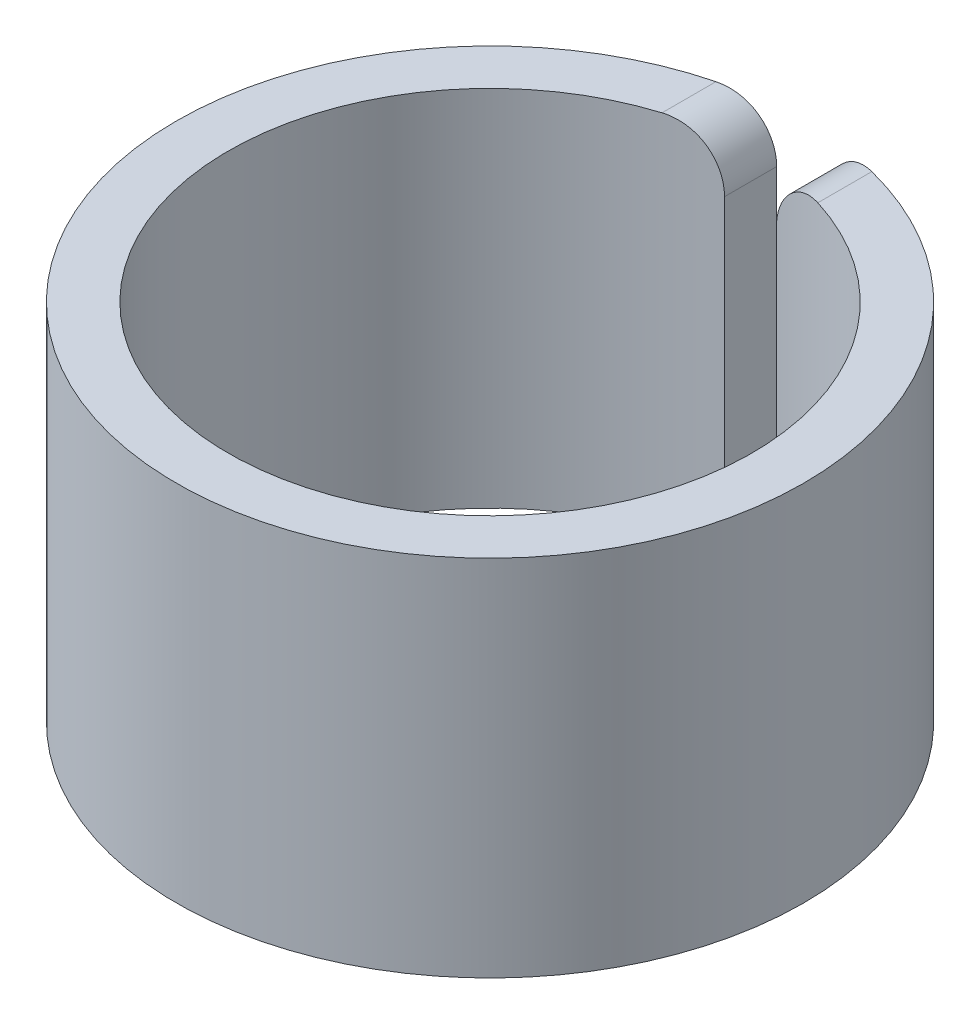
ISO-10303-21;
HEADER;
FILE_DESCRIPTION(('STEP AP214'),'2;1');
FILE_NAME('part.step','',(''),(''),'','','');
FILE_SCHEMA(('AUTOMOTIVE_DESIGN { 1 0 10303 214 1 1 1 1 }'));
ENDSEC;
DATA;
#1=APPLICATION_CONTEXT('core data for automotive mechanical design processes');
#2=APPLICATION_PROTOCOL_DEFINITION('international standard','automotive_design',2000,#1);
#3=PRODUCT_CONTEXT('',#1,'mechanical');
#4=PRODUCT('Part','Part','',(#3));
#5=PRODUCT_RELATED_PRODUCT_CATEGORY('part','',(#4));
#6=PRODUCT_DEFINITION_FORMATION('','',#4);
#7=PRODUCT_DEFINITION_CONTEXT('part definition',#1,'design');
#8=PRODUCT_DEFINITION('design','',#6,#7);
#9=PRODUCT_DEFINITION_SHAPE('','',#8);
#10=(LENGTH_UNIT() NAMED_UNIT(*) SI_UNIT(.MILLI.,.METRE.));
#11=(NAMED_UNIT(*) PLANE_ANGLE_UNIT() SI_UNIT($,.RADIAN.));
#12=(NAMED_UNIT(*) SI_UNIT($,.STERADIAN.) SOLID_ANGLE_UNIT());
#13=UNCERTAINTY_MEASURE_WITH_UNIT(LENGTH_MEASURE(1.E-05),#10,'distance_accuracy_value','');
#14=(GEOMETRIC_REPRESENTATION_CONTEXT(3) GLOBAL_UNCERTAINTY_ASSIGNED_CONTEXT((#13)) GLOBAL_UNIT_ASSIGNED_CONTEXT((#10,
#11,#12)) REPRESENTATION_CONTEXT('',''));
#15=CARTESIAN_POINT('',(0.,0.,0.));
#16=DIRECTION('',(0.,0.,1.));
#17=DIRECTION('',(1.,0.,0.));
#18=AXIS2_PLACEMENT_3D('',#15,#16,#17);
#19=CARTESIAN_POINT('',(0.,3.5,0.));
#20=DIRECTION('',(0.,1.,0.));
#21=DIRECTION('',(0.,0.,1.));
#22=AXIS2_PLACEMENT_3D('',#19,#20,#21);
#23=PLANE('',#22);
#24=CARTESIAN_POINT('',(0.,3.5,0.));
#25=DIRECTION('',(0.,1.,0.));
#26=DIRECTION('',(1.,0.,0.));
#27=AXIS2_PLACEMENT_3D('',#24,#25,#26);
#28=CIRCLE('',#27,6.04);
#29=CARTESIAN_POINT('',(-1.50000000000031,3.5,-5.85077772608045));
#30=VERTEX_POINT('',#29);
#31=CARTESIAN_POINT('',(1.5000000000003,3.5,-5.85077772608045));
#32=VERTEX_POINT('',#31);
#33=EDGE_CURVE('E212',#30,#32,#28,.T.);
#34=ORIENTED_EDGE('',*,*,#33,.T.);
#35=DIRECTION('',(0.,0.,-1.));
#36=VECTOR('',#35,1.);
#37=CARTESIAN_POINT('',(1.5000000000003,3.5,-5.01513708686011));
#38=LINE('',#37,#36);
#39=CARTESIAN_POINT('',(1.5000000000003,3.5,-4.8116109568417));
#40=VERTEX_POINT('',#39);
#41=EDGE_CURVE('E130',#32,#40,#38,.F.);
#42=ORIENTED_EDGE('',*,*,#41,.T.);
#43=CARTESIAN_POINT('',(0.,3.5,0.));
#44=DIRECTION('',(0.,1.,0.));
#45=DIRECTION('',(0.,0.,1.));
#46=AXIS2_PLACEMENT_3D('',#43,#44,#45);
#47=CIRCLE('',#46,5.04);
#48=CARTESIAN_POINT('',(-1.50000000000031,3.5,-4.8116109568417));
#49=VERTEX_POINT('',#48);
#50=EDGE_CURVE('E216',#49,#40,#47,.T.);
#51=ORIENTED_EDGE('',*,*,#50,.F.);
#52=DIRECTION('',(0.,0.,1.));
#53=VECTOR('',#52,1.);
#54=CARTESIAN_POINT('',(-1.50000000000031,3.5,-6.01926905861498));
#55=LINE('',#54,#53);
#56=EDGE_CURVE('E133',#49,#30,#55,.F.);
#57=ORIENTED_EDGE('',*,*,#56,.T.);
#58=EDGE_LOOP('',(#34,#42,#51,#57));
#59=FACE_BOUND('',#58,.T.);
#60=ADVANCED_FACE('F39',(#59),#23,.T.);
#61=CARTESIAN_POINT('',(0.,-3.5,0.));
#62=DIRECTION('',(0.,1.,0.));
#63=DIRECTION('',(0.,0.,1.));
#64=AXIS2_PLACEMENT_3D('',#61,#62,#63);
#65=PLANE('',#64);
#66=CARTESIAN_POINT('',(0.,-3.5,0.));
#67=DIRECTION('',(0.,1.,0.));
#68=DIRECTION('',(1.,0.,0.));
#69=AXIS2_PLACEMENT_3D('',#66,#67,#68);
#70=CIRCLE('',#69,6.04);
#71=CARTESIAN_POINT('',(-1.50000000000031,-3.5,-5.85077772608045));
#72=VERTEX_POINT('',#71);
#73=CARTESIAN_POINT('',(1.5000000000003,-3.5,-5.85077772608045));
#74=VERTEX_POINT('',#73);
#75=EDGE_CURVE('E213',#72,#74,#70,.T.);
#76=ORIENTED_EDGE('',*,*,#75,.F.);
#77=DIRECTION('',(0.,0.,1.));
#78=VECTOR('',#77,1.);
#79=CARTESIAN_POINT('',(-1.50000000000031,-3.5,0.));
#80=LINE('',#79,#78);
#81=CARTESIAN_POINT('',(-1.50000000000031,-3.5,-4.8116109568417));
#82=VERTEX_POINT('',#81);
#83=EDGE_CURVE('E12',#72,#82,#80,.T.);
#84=ORIENTED_EDGE('',*,*,#83,.T.);
#85=CARTESIAN_POINT('',(0.,-3.5,0.));
#86=DIRECTION('',(0.,1.,0.));
#87=DIRECTION('',(0.,0.,1.));
#88=AXIS2_PLACEMENT_3D('',#85,#86,#87);
#89=CIRCLE('',#88,5.04);
#90=CARTESIAN_POINT('',(1.5000000000003,-3.5,-4.8116109568417));
#91=VERTEX_POINT('',#90);
#92=EDGE_CURVE('E219',#82,#91,#89,.T.);
#93=ORIENTED_EDGE('',*,*,#92,.T.);
#94=DIRECTION('',(0.,0.,-1.));
#95=VECTOR('',#94,1.);
#96=CARTESIAN_POINT('',(1.50000000000031,-3.5,0.));
#97=LINE('',#96,#95);
#98=EDGE_CURVE('E48',#91,#74,#97,.T.);
#99=ORIENTED_EDGE('',*,*,#98,.T.);
#100=EDGE_LOOP('',(#76,#84,#93,#99));
#101=FACE_BOUND('',#100,.T.);
#102=ADVANCED_FACE('F199',(#101),#65,.F.);
#103=CARTESIAN_POINT('',(0.,3.5,0.));
#104=DIRECTION('',(0.,-1.,0.));
#105=DIRECTION('',(0.,0.,-1.));
#106=AXIS2_PLACEMENT_3D('',#103,#104,#105);
#107=CYLINDRICAL_SURFACE('',#106,6.04);
#108=DIRECTION('',(0.,-1.,0.));
#109=VECTOR('',#108,1.);
#110=CARTESIAN_POINT('',(0.500000000000303,3.5,-6.01926905861498));
#111=LINE('',#110,#109);
#112=CARTESIAN_POINT('',(0.500000000000303,-2.5,-6.01926905861498));
#113=VERTEX_POINT('',#112);
#114=CARTESIAN_POINT('',(0.500000000000303,2.5,-6.01926905861498));
#115=VERTEX_POINT('',#114);
#116=EDGE_CURVE('E115',#113,#115,#111,.F.);
#117=ORIENTED_EDGE('',*,*,#116,.T.);
#118=CARTESIAN_POINT('',(0.500000000000303,2.5,-6.01926905861498));
#119=CARTESIAN_POINT('',(0.500000147538638,2.52801511580829,-6.01926792187514));
#120=CARTESIAN_POINT('',(0.501178018526926,2.55601683338028,-6.0191713314579));
#121=CARTESIAN_POINT('',(0.505876756069402,2.61182037486417,-6.0187786884757));
#122=CARTESIAN_POINT('',(0.509397525494623,2.63962220701439,-6.01848264417946));
#123=CARTESIAN_POINT('',(0.523440795911717,2.72238418462499,-6.01728375625036));
#124=CARTESIAN_POINT('',(0.537444349863762,2.77679071900414,-6.01607020719416));
#125=CARTESIAN_POINT('',(0.574336183166915,2.88247193719496,-6.0126597358256));
#126=CARTESIAN_POINT('',(0.597229092910345,2.93374497265652,-6.01046230092373));
#127=CARTESIAN_POINT('',(0.651221256614512,3.03169473174886,-6.00485174931685));
#128=CARTESIAN_POINT('',(0.682318917485741,3.07837234524423,-6.00143886856601));
#129=CARTESIAN_POINT('',(0.751737827040241,3.16574249073153,-5.99313829226483));
#130=CARTESIAN_POINT('',(0.79004863317618,3.20644352532634,-5.98825272267212));
#131=CARTESIAN_POINT('',(0.872761097291666,3.28080970899916,-5.9767572564229));
#132=CARTESIAN_POINT('',(0.917163062779286,3.31447450264061,-5.97014727269531));
#133=CARTESIAN_POINT('',(1.0106746306673,3.37385839935954,-5.95502953227151));
#134=CARTESIAN_POINT('',(1.05978262139599,3.39958021001693,-5.94652242396808));
#135=CARTESIAN_POINT('',(1.16124414357262,3.44248403970932,-5.92754343910031));
#136=CARTESIAN_POINT('',(1.2135972570549,3.45966715595205,-5.91707181521121));
#137=CARTESIAN_POINT('',(1.30517106124924,3.48163278777757,-5.89742920077249));
#138=CARTESIAN_POINT('',(1.34399592878338,3.48853479347084,-5.88870608691224));
#139=CARTESIAN_POINT('',(1.42191280396622,3.49771828045074,-5.87038183772152));
#140=CARTESIAN_POINT('',(1.46100423448013,3.50000772065479,-5.86078224472285));
#141=CARTESIAN_POINT('',(1.5000000000003,3.5,-5.85077772608045));
#142=B_SPLINE_CURVE_WITH_KNOTS('',3,(#118,#119,#120,#121,#122,#123,#124,#125,#126,#127,#128,
#129,#130,#131,#132,#133,#134,#135,#136,#137,#138,#139,#140,#141),.UNSPECIFIED.,.F.,.F.,(4,2,2,
2,2,2,2,2,2,2,2,4),(0.,0.0839938001038455,0.167984118314159,0.335698459748334,0.503500279649101,
0.671269541970228,0.838797764919631,1.006334448533,1.17381395954846,1.34127194416278,
1.46217054404459,1.58286035580051),.UNSPECIFIED.);
#143=EDGE_CURVE('E186',#115,#32,#142,.T.);
#144=ORIENTED_EDGE('',*,*,#143,.T.);
#145=ORIENTED_EDGE('',*,*,#33,.F.);
#146=CARTESIAN_POINT('',(-1.50000000000031,3.5,-5.85077772608045));
#147=CARTESIAN_POINT('',(-1.4721998573771,3.49999956408464,-5.85790610267146));
#148=CARTESIAN_POINT('',(-1.44435978180637,3.49883987592234,-5.86483110534403));
#149=CARTESIAN_POINT('',(-1.38876592900515,3.49418620818695,-5.87824339439247));
#150=CARTESIAN_POINT('',(-1.36101216359701,3.49069192185657,-5.88473062312316));
#151=CARTESIAN_POINT('',(-1.27818425629119,3.47669130318036,-5.90347657873336));
#152=CARTESIAN_POINT('',(-1.22349908285171,3.46266725690404,-5.91503092776452));
#153=CARTESIAN_POINT('',(-1.11687283618476,3.42542458694574,-5.93608966518361));
#154=CARTESIAN_POINT('',(-1.06493561100482,3.40219343733993,-5.94559123351601));
#155=CARTESIAN_POINT('',(-0.965524964342736,3.34709021852483,-5.96254169654858));
#156=CARTESIAN_POINT('',(-0.918048925009836,3.31522326004576,-5.96999180007869));
#157=CARTESIAN_POINT('',(-0.829959143016247,3.24442972629992,-5.98286845908603));
#158=CARTESIAN_POINT('',(-0.789227533931792,3.20565643747073,-5.9883323702646));
#159=CARTESIAN_POINT('',(-0.714747844311709,3.12171326643041,-5.99767856181006));
#160=CARTESIAN_POINT('',(-0.681001606045793,3.07654170206272,-6.00156042520029));
#161=CARTESIAN_POINT('',(-0.621768165515724,2.9814798996119,-6.00798539968069));
#162=CARTESIAN_POINT('',(-0.596219704465806,2.93162843932292,-6.01053853365416));
#163=CARTESIAN_POINT('',(-0.553793715007384,2.82833843916365,-6.01459635671826));
#164=CARTESIAN_POINT('',(-0.536911040401493,2.77490204958206,-6.01610166825027));
#165=CARTESIAN_POINT('',(-0.516428219291182,2.68429332007422,-6.01788743306866));
#166=CARTESIAN_POINT('',(-0.510271755081222,2.6476826967012,-6.01840942627051));
#167=CARTESIAN_POINT('',(-0.502057939228013,2.57405307654975,-6.01909814898589));
#168=CARTESIAN_POINT('',(-0.499994873206612,2.53703472171021,-6.01926537377826));
#169=CARTESIAN_POINT('',(-0.500000000000306,2.5,-6.01926905861498));
#170=B_SPLINE_CURVE_WITH_KNOTS('',3,(#146,#147,#148,#149,#150,#151,#152,#153,#154,#155,#156,
#157,#158,#159,#160,#161,#162,#163,#164,#165,#166,#167,#168,#169),.UNSPECIFIED.,.F.,.F.,(4,2,2,
2,2,2,2,2,2,2,2,4),(0.,0.0860496929543468,0.172110694734235,0.344096862670815,0.516317819068098,
0.688437075678145,0.857127430326559,1.02586221758934,1.19330504885029,1.36064832841956,
1.4718181265732,1.58283262234606),.UNSPECIFIED.);
#171=CARTESIAN_POINT('',(-0.500000000000306,2.5,-6.01926905861498));
#172=VERTEX_POINT('',#171);
#173=EDGE_CURVE('E179',#30,#172,#170,.T.);
#174=ORIENTED_EDGE('',*,*,#173,.T.);
#175=DIRECTION('',(0.,-1.,0.));
#176=VECTOR('',#175,1.);
#177=CARTESIAN_POINT('',(-0.500000000000306,3.5,-6.01926905861498));
#178=LINE('',#177,#176);
#179=CARTESIAN_POINT('',(-0.500000000000306,-2.5,-6.01926905861498));
#180=VERTEX_POINT('',#179);
#181=EDGE_CURVE('E223',#172,#180,#178,.T.);
#182=ORIENTED_EDGE('',*,*,#181,.T.);
#183=CARTESIAN_POINT('',(-0.500000000000306,-2.5,-6.01926905861498));
#184=CARTESIAN_POINT('',(-0.500000147538642,-2.52801511580829,-6.01926792187514));
#185=CARTESIAN_POINT('',(-0.501178018526929,-2.55601683338028,-6.0191713314579));
#186=CARTESIAN_POINT('',(-0.505876756069406,-2.61182037486417,-6.0187786884757));
#187=CARTESIAN_POINT('',(-0.509397525494626,-2.63962220701439,-6.01848264417946));
#188=CARTESIAN_POINT('',(-0.523440795911721,-2.72238418462499,-6.01728375625036));
#189=CARTESIAN_POINT('',(-0.537444349863765,-2.77679071900414,-6.01607020719416));
#190=CARTESIAN_POINT('',(-0.574336183166918,-2.88247193719496,-6.0126597358256));
#191=CARTESIAN_POINT('',(-0.597229092910349,-2.93374497265652,-6.01046230092373));
#192=CARTESIAN_POINT('',(-0.651221256614516,-3.03169473174886,-6.00485174931685));
#193=CARTESIAN_POINT('',(-0.682318917485745,-3.07837234524423,-6.00143886856601));
#194=CARTESIAN_POINT('',(-0.751737827040244,-3.16574249073153,-5.99313829226483));
#195=CARTESIAN_POINT('',(-0.790048633176183,-3.20644352532634,-5.98825272267212));
#196=CARTESIAN_POINT('',(-0.87276109729167,-3.28080970899916,-5.9767572564229));
#197=CARTESIAN_POINT('',(-0.91716306277929,-3.31447450264061,-5.97014727269531));
#198=CARTESIAN_POINT('',(-1.0106746306673,-3.37385839935954,-5.95502953227151));
#199=CARTESIAN_POINT('',(-1.05978262139599,-3.39958021001693,-5.94652242396808));
#200=CARTESIAN_POINT('',(-1.16124414357262,-3.44248403970933,-5.92754343910031));
#201=CARTESIAN_POINT('',(-1.2135972570549,-3.45966715595205,-5.91707181521121));
#202=CARTESIAN_POINT('',(-1.30517106124925,-3.48163278777757,-5.89742920077249));
#203=CARTESIAN_POINT('',(-1.34399592878338,-3.48853479347084,-5.88870608691224));
#204=CARTESIAN_POINT('',(-1.42191280396622,-3.49771828045074,-5.87038183772152));
#205=CARTESIAN_POINT('',(-1.46100423448013,-3.50000772065479,-5.86078224472285));
#206=CARTESIAN_POINT('',(-1.50000000000031,-3.5,-5.85077772608045));
#207=B_SPLINE_CURVE_WITH_KNOTS('',3,(#183,#184,#185,#186,#187,#188,#189,#190,#191,#192,#193,
#194,#195,#196,#197,#198,#199,#200,#201,#202,#203,#204,#205,#206),.UNSPECIFIED.,.F.,.F.,(4,2,2,
2,2,2,2,2,2,2,2,4),(0.,0.0839938001038459,0.16798411831416,0.335698459748334,0.503500279649101,
0.671269541970228,0.838797764919632,1.006334448533,1.17381395954846,1.34127194416278,
1.46217054404459,1.58286035580051),.UNSPECIFIED.);
#208=EDGE_CURVE('E187',#180,#72,#207,.T.);
#209=ORIENTED_EDGE('',*,*,#208,.T.);
#210=ORIENTED_EDGE('',*,*,#75,.T.);
#211=CARTESIAN_POINT('',(1.5000000000003,-3.5,-5.85077772608045));
#212=CARTESIAN_POINT('',(1.47219985737709,-3.49999956408464,-5.85790610267147));
#213=CARTESIAN_POINT('',(1.44435978180637,-3.49883987592234,-5.86483110534404));
#214=CARTESIAN_POINT('',(1.38876592900515,-3.49418620818695,-5.87824339439247));
#215=CARTESIAN_POINT('',(1.36101216359701,-3.49069192185657,-5.88473062312316));
#216=CARTESIAN_POINT('',(1.27818425629118,-3.47669130318036,-5.90347657873336));
#217=CARTESIAN_POINT('',(1.22349908285171,-3.46266725690404,-5.91503092776452));
#218=CARTESIAN_POINT('',(1.11687283618475,-3.42542458694574,-5.93608966518361));
#219=CARTESIAN_POINT('',(1.06493561100481,-3.40219343733993,-5.94559123351601));
#220=CARTESIAN_POINT('',(0.965524964342732,-3.34709021852483,-5.96254169654858));
#221=CARTESIAN_POINT('',(0.918048925009832,-3.31522326004576,-5.96999180007869));
#222=CARTESIAN_POINT('',(0.829959143016243,-3.24442972629992,-5.98286845908603));
#223=CARTESIAN_POINT('',(0.789227533931788,-3.20565643747073,-5.9883323702646));
#224=CARTESIAN_POINT('',(0.714747844311705,-3.12171326643041,-5.99767856181006));
#225=CARTESIAN_POINT('',(0.681001606045789,-3.07654170206272,-6.00156042520029));
#226=CARTESIAN_POINT('',(0.62176816551572,-2.9814798996119,-6.00798539968069));
#227=CARTESIAN_POINT('',(0.596219704465802,-2.93162843932292,-6.01053853365416));
#228=CARTESIAN_POINT('',(0.55379371500738,-2.82833843916365,-6.01459635671826));
#229=CARTESIAN_POINT('',(0.536911040401489,-2.77490204958206,-6.01610166825027));
#230=CARTESIAN_POINT('',(0.516428219291178,-2.68429332007422,-6.01788743306866));
#231=CARTESIAN_POINT('',(0.510271755081218,-2.6476826967012,-6.01840942627051));
#232=CARTESIAN_POINT('',(0.50205793922801,-2.57405307654975,-6.01909814898589));
#233=CARTESIAN_POINT('',(0.499994873206608,-2.53703472171021,-6.01926537377826));
#234=CARTESIAN_POINT('',(0.500000000000302,-2.5,-6.01926905861498));
#235=B_SPLINE_CURVE_WITH_KNOTS('',3,(#211,#212,#213,#214,#215,#216,#217,#218,#219,#220,#221,
#222,#223,#224,#225,#226,#227,#228,#229,#230,#231,#232,#233,#234),.UNSPECIFIED.,.F.,.F.,(4,2,2,
2,2,2,2,2,2,2,2,4),(0.,0.086049692954347,0.172110694734236,0.344096862670815,0.516317819068098,
0.688437075678146,0.857127430326559,1.02586221758934,1.19330504885029,1.36064832841956,
1.4718181265732,1.58283262234606),.UNSPECIFIED.);
#236=EDGE_CURVE('E203',#74,#113,#235,.T.);
#237=ORIENTED_EDGE('',*,*,#236,.T.);
#238=EDGE_LOOP('',(#117,#144,#145,#174,#182,#209,#210,#237));
#239=FACE_BOUND('',#238,.T.);
#240=ADVANCED_FACE('F151',(#239),#107,.T.);
#241=CARTESIAN_POINT('',(0.,3.5,0.));
#242=DIRECTION('',(0.,-1.,0.));
#243=DIRECTION('',(0.,0.,-1.));
#244=AXIS2_PLACEMENT_3D('',#241,#242,#243);
#245=CYLINDRICAL_SURFACE('',#244,5.04);
#246=ORIENTED_EDGE('',*,*,#50,.T.);
#247=CARTESIAN_POINT('',(1.5000000000003,3.5,-4.8116109568417));
#248=CARTESIAN_POINT('',(1.47235466098163,3.49999945205913,-4.82023056348442));
#249=CARTESIAN_POINT('',(1.44464484396533,3.49885270648434,-4.82860592996612));
#250=CARTESIAN_POINT('',(1.38925891458971,3.49423837000455,-4.84483138500673));
#251=CARTESIAN_POINT('',(1.36158281047934,3.49077029438553,-4.85268136348338));
#252=CARTESIAN_POINT('',(1.27888864120155,3.47684580428789,-4.87537668155754));
#253=CARTESIAN_POINT('',(1.2241823254382,3.46286917054492,-4.88937436343542));
#254=CARTESIAN_POINT('',(1.11732697775228,3.4256196496139,-4.91489685989582));
#255=CARTESIAN_POINT('',(1.06518261114496,3.40233046100243,-4.92641728342446));
#256=CARTESIAN_POINT('',(0.965288514106293,3.34695904297817,-4.9469604082819));
#257=CARTESIAN_POINT('',(0.917535379610072,3.31488370262826,-4.95598505540898));
#258=CARTESIAN_POINT('',(0.829310711084126,3.24383625832326,-4.97149851792281));
#259=CARTESIAN_POINT('',(0.788669101829014,3.2050893345771,-4.97805286806636));
#260=CARTESIAN_POINT('',(0.714321645544194,3.12116980194792,-4.98926466553541));
#261=CARTESIAN_POINT('',(0.680617844135953,3.0759953045077,-4.99392155378714));
#262=CARTESIAN_POINT('',(0.621555799728585,2.9810695032267,-5.00161464145933));
#263=CARTESIAN_POINT('',(0.596109294904171,2.9313744054707,-5.00466821256977));
#264=CARTESIAN_POINT('',(0.553827305258496,2.82840544493702,-5.00952400709026));
#265=CARTESIAN_POINT('',(0.536986675611898,2.77513374195492,-5.01132697837373));
#266=CARTESIAN_POINT('',(0.516488779847345,2.68462937572363,-5.01347258873422));
#267=CARTESIAN_POINT('',(0.510309795676333,2.64795409737994,-5.01410146992499));
#268=CARTESIAN_POINT('',(0.502065589905511,2.57419087588837,-5.01493119096636));
#269=CARTESIAN_POINT('',(0.499994676637284,2.53710357538091,-5.01513262306809));
#270=CARTESIAN_POINT('',(0.500000000000303,2.5,-5.01513708686011));
#271=B_SPLINE_CURVE_WITH_KNOTS('',3,(#247,#248,#249,#250,#251,#252,#253,#254,#255,#256,#257,
#258,#259,#260,#261,#262,#263,#264,#265,#266,#267,#268,#269,#270),.UNSPECIFIED.,.F.,.F.,(4,2,2,
2,2,2,2,2,2,2,2,4),(0.,0.0868262389380044,0.173670613612933,0.347289877636959,0.521214398227367,
0.695002936177767,0.863787380900787,1.03262152087179,1.19958651755578,1.36645158092461,
1.47782673071679,1.58904746389387),.UNSPECIFIED.);
#272=CARTESIAN_POINT('',(0.500000000000303,2.5,-5.01513708686011));
#273=VERTEX_POINT('',#272);
#274=EDGE_CURVE('E125',#40,#273,#271,.T.);
#275=ORIENTED_EDGE('',*,*,#274,.T.);
#276=DIRECTION('',(0.,-1.,0.));
#277=VECTOR('',#276,1.);
#278=CARTESIAN_POINT('',(0.500000000000303,3.5,-5.01513708686011));
#279=LINE('',#278,#277);
#280=CARTESIAN_POINT('',(0.500000000000303,-2.5,-5.01513708686011));
#281=VERTEX_POINT('',#280);
#282=EDGE_CURVE('E112',#281,#273,#279,.F.);
#283=ORIENTED_EDGE('',*,*,#282,.F.);
#284=CARTESIAN_POINT('',(0.500000000000303,-2.5,-5.01513708686011));
#285=CARTESIAN_POINT('',(0.500000130516033,-2.52796277486556,-5.01513573047516));
#286=CARTESIAN_POINT('',(0.501173625099433,-2.55591218668342,-5.0150202302727));
#287=CARTESIAN_POINT('',(0.505854787821813,-2.61161170126217,-5.01455073647461));
#288=CARTESIAN_POINT('',(0.509362365812216,-2.63936181167878,-5.01419675208986));
#289=CARTESIAN_POINT('',(0.523352991984482,-2.72197173554911,-5.01276324213295));
#290=CARTESIAN_POINT('',(0.537304021942896,-2.77627929154071,-5.01131221791885));
#291=CARTESIAN_POINT('',(0.57405321355968,-2.8817697290945,-5.00723483695421));
#292=CARTESIAN_POINT('',(0.596856145591088,-2.93295090858128,-5.00460784634724));
#293=CARTESIAN_POINT('',(0.650622117401691,-3.03072308313293,-4.99790173797959));
#294=CARTESIAN_POINT('',(0.681583506625834,-3.0773150040442,-4.993822913884));
#295=CARTESIAN_POINT('',(0.750644581299824,-3.16449466020526,-4.98390842773313));
#296=CARTESIAN_POINT('',(0.788729457508292,-3.20509454473148,-4.97807639547309));
#297=CARTESIAN_POINT('',(0.870888006051754,-3.27928231308462,-4.96436142805657));
#298=CARTESIAN_POINT('',(0.914961619238756,-3.31287026615684,-4.95647851315499));
#299=CARTESIAN_POINT('',(1.00767148376548,-3.37214622309989,-4.93846372798346));
#300=CARTESIAN_POINT('',(1.0563048866545,-3.39783911657749,-4.92833325640369));
#301=CARTESIAN_POINT('',(1.15666540072851,-3.44079739791067,-4.90574842504108));
#302=CARTESIAN_POINT('',(1.20839270882641,-3.45806224871786,-4.89329391723681));
#303=CARTESIAN_POINT('',(1.30030366099988,-3.48070018804334,-4.86954502965092));
#304=CARTESIAN_POINT('',(1.34016063332875,-3.48796246845658,-4.8587318050754));
#305=CARTESIAN_POINT('',(1.42006467147968,-3.49761253388159,-4.83598614787175));
#306=CARTESIAN_POINT('',(1.46011124359928,-3.50000939238691,-4.824055842048));
#307=CARTESIAN_POINT('',(1.5000000000003,-3.5,-4.8116109568417));
#308=B_SPLINE_CURVE_WITH_KNOTS('',3,(#284,#285,#286,#287,#288,#289,#290,#291,#292,#293,#294,
#295,#296,#297,#298,#299,#300,#301,#302,#303,#304,#305,#306,#307),.UNSPECIFIED.,.F.,.F.,(4,2,2,
2,2,2,2,2,2,2,2,4),(0.,0.083836906818474,0.167670575818097,0.335076823276727,0.502573413057089,
0.670036142224165,0.837154521315753,1.00427124997618,1.17128426951413,1.33830793000068,
1.46381448614516,1.58908677010451),.UNSPECIFIED.);
#309=EDGE_CURVE('E122',#281,#91,#308,.T.);
#310=ORIENTED_EDGE('',*,*,#309,.T.);
#311=ORIENTED_EDGE('',*,*,#92,.F.);
#312=CARTESIAN_POINT('',(-1.50000000000031,-3.5,-4.8116109568417));
#313=CARTESIAN_POINT('',(-1.47235466098163,-3.49999945205913,-4.82023056348442));
#314=CARTESIAN_POINT('',(-1.44464484396533,-3.49885270648434,-4.82860592996612));
#315=CARTESIAN_POINT('',(-1.38925891458971,-3.49423837000455,-4.84483138500673));
#316=CARTESIAN_POINT('',(-1.36158281047934,-3.49077029438553,-4.85268136348338));
#317=CARTESIAN_POINT('',(-1.27888864120156,-3.47684580428789,-4.87537668155754));
#318=CARTESIAN_POINT('',(-1.22418232543821,-3.46286917054492,-4.88937436343542));
#319=CARTESIAN_POINT('',(-1.11732697775228,-3.4256196496139,-4.91489685989582));
#320=CARTESIAN_POINT('',(-1.06518261114496,-3.40233046100243,-4.92641728342446));
#321=CARTESIAN_POINT('',(-0.965288514106296,-3.34695904297817,-4.9469604082819));
#322=CARTESIAN_POINT('',(-0.917535379610075,-3.31488370262826,-4.95598505540898));
#323=CARTESIAN_POINT('',(-0.829310711084129,-3.24383625832326,-4.97149851792281));
#324=CARTESIAN_POINT('',(-0.788669101829017,-3.2050893345771,-4.97805286806636));
#325=CARTESIAN_POINT('',(-0.714321645544197,-3.12116980194792,-4.98926466553541));
#326=CARTESIAN_POINT('',(-0.680617844135956,-3.0759953045077,-4.99392155378714));
#327=CARTESIAN_POINT('',(-0.621555799728588,-2.9810695032267,-5.00161464145933));
#328=CARTESIAN_POINT('',(-0.596109294904174,-2.9313744054707,-5.00466821256977));
#329=CARTESIAN_POINT('',(-0.5538273052585,-2.82840544493702,-5.00952400709026));
#330=CARTESIAN_POINT('',(-0.536986675611901,-2.77513374195493,-5.01132697837373));
#331=CARTESIAN_POINT('',(-0.516488779847348,-2.68462937572363,-5.01347258873422));
#332=CARTESIAN_POINT('',(-0.510309795676336,-2.64795409737994,-5.01410146992499));
#333=CARTESIAN_POINT('',(-0.502065589905514,-2.57419087588837,-5.01493119096636));
#334=CARTESIAN_POINT('',(-0.499994676637287,-2.53710357538092,-5.01513262306809));
#335=CARTESIAN_POINT('',(-0.500000000000306,-2.5,-5.01513708686011));
#336=B_SPLINE_CURVE_WITH_KNOTS('',3,(#312,#313,#314,#315,#316,#317,#318,#319,#320,#321,#322,
#323,#324,#325,#326,#327,#328,#329,#330,#331,#332,#333,#334,#335),.UNSPECIFIED.,.F.,.F.,(4,2,2,
2,2,2,2,2,2,2,2,4),(0.,0.0868262389380048,0.173670613612933,0.347289877636959,0.521214398227366,
0.695002936177767,0.863787380900786,1.03262152087179,1.19958651755578,1.36645158092461,
1.47782673071679,1.58904746389387),.UNSPECIFIED.);
#337=CARTESIAN_POINT('',(-0.500000000000306,-2.5,-5.01513708686011));
#338=VERTEX_POINT('',#337);
#339=EDGE_CURVE('E55',#82,#338,#336,.T.);
#340=ORIENTED_EDGE('',*,*,#339,.T.);
#341=DIRECTION('',(0.,-1.,0.));
#342=VECTOR('',#341,1.);
#343=CARTESIAN_POINT('',(-0.500000000000306,3.5,-5.01513708686011));
#344=LINE('',#343,#342);
#345=CARTESIAN_POINT('',(-0.500000000000306,2.5,-5.01513708686011));
#346=VERTEX_POINT('',#345);
#347=EDGE_CURVE('E126',#346,#338,#344,.T.);
#348=ORIENTED_EDGE('',*,*,#347,.F.);
#349=CARTESIAN_POINT('',(-0.500000000000306,2.5,-5.01513708686011));
#350=CARTESIAN_POINT('',(-0.500000130516036,2.52796277486556,-5.01513573047516));
#351=CARTESIAN_POINT('',(-0.501173625099436,2.55591218668342,-5.0150202302727));
#352=CARTESIAN_POINT('',(-0.505854787821816,2.61161170126217,-5.01455073647461));
#353=CARTESIAN_POINT('',(-0.509362365812219,2.63936181167878,-5.01419675208986));
#354=CARTESIAN_POINT('',(-0.523352991984485,2.72197173554911,-5.01276324213295));
#355=CARTESIAN_POINT('',(-0.537304021942899,2.77627929154071,-5.01131221791885));
#356=CARTESIAN_POINT('',(-0.574053213559683,2.8817697290945,-5.00723483695421));
#357=CARTESIAN_POINT('',(-0.596856145591091,2.93295090858128,-5.00460784634724));
#358=CARTESIAN_POINT('',(-0.650622117401693,3.03072308313293,-4.99790173797959));
#359=CARTESIAN_POINT('',(-0.681583506625836,3.0773150040442,-4.993822913884));
#360=CARTESIAN_POINT('',(-0.750644581299827,3.16449466020526,-4.98390842773313));
#361=CARTESIAN_POINT('',(-0.788729457508295,3.20509454473148,-4.97807639547309));
#362=CARTESIAN_POINT('',(-0.870888006051757,3.27928231308462,-4.96436142805657));
#363=CARTESIAN_POINT('',(-0.914961619238759,3.31287026615684,-4.95647851315499));
#364=CARTESIAN_POINT('',(-1.00767148376548,3.37214622309989,-4.93846372798346));
#365=CARTESIAN_POINT('',(-1.0563048866545,3.39783911657749,-4.92833325640369));
#366=CARTESIAN_POINT('',(-1.15666540072851,3.44079739791067,-4.90574842504108));
#367=CARTESIAN_POINT('',(-1.20839270882641,3.45806224871786,-4.89329391723681));
#368=CARTESIAN_POINT('',(-1.30030366099988,3.48070018804334,-4.86954502965092));
#369=CARTESIAN_POINT('',(-1.34016063332876,3.48796246845658,-4.85873180507539));
#370=CARTESIAN_POINT('',(-1.42006467147968,3.49761253388159,-4.83598614787175));
#371=CARTESIAN_POINT('',(-1.46011124359928,3.50000939238691,-4.824055842048));
#372=CARTESIAN_POINT('',(-1.50000000000031,3.5,-4.8116109568417));
#373=B_SPLINE_CURVE_WITH_KNOTS('',3,(#349,#350,#351,#352,#353,#354,#355,#356,#357,#358,#359,
#360,#361,#362,#363,#364,#365,#366,#367,#368,#369,#370,#371,#372),.UNSPECIFIED.,.F.,.F.,(4,2,2,
2,2,2,2,2,2,2,2,4),(0.,0.083836906818474,0.167670575818097,0.335076823276727,0.502573413057088,
0.670036142224165,0.837154521315753,1.00427124997618,1.17128426951413,1.33830793000068,
1.46381448614516,1.58908677010451),.UNSPECIFIED.);
#374=EDGE_CURVE('E63',#346,#49,#373,.T.);
#375=ORIENTED_EDGE('',*,*,#374,.T.);
#376=EDGE_LOOP('',(#246,#275,#283,#310,#311,#340,#348,#375));
#377=FACE_BOUND('',#376,.T.);
#378=ADVANCED_FACE('F121',(#377),#245,.F.);
#379=CARTESIAN_POINT('',(-0.500000000000306,-3.5,0.));
#380=DIRECTION('',(-1.,0.,0.));
#381=DIRECTION('',(0.,0.,1.));
#382=AXIS2_PLACEMENT_3D('',#379,#380,#381);
#383=PLANE('',#382);
#384=ORIENTED_EDGE('',*,*,#181,.F.);
#385=DIRECTION('',(0.,0.,1.));
#386=VECTOR('',#385,1.);
#387=CARTESIAN_POINT('',(-0.500000000000306,2.5,-5.01513708686011));
#388=LINE('',#387,#386);
#389=EDGE_CURVE('E240',#172,#346,#388,.T.);
#390=ORIENTED_EDGE('',*,*,#389,.T.);
#391=ORIENTED_EDGE('',*,*,#347,.T.);
#392=DIRECTION('',(0.,0.,1.));
#393=VECTOR('',#392,1.);
#394=CARTESIAN_POINT('',(-0.500000000000306,-2.5,0.));
#395=LINE('',#394,#393);
#396=EDGE_CURVE('E234',#338,#180,#395,.F.);
#397=ORIENTED_EDGE('',*,*,#396,.T.);
#398=EDGE_LOOP('',(#384,#390,#391,#397));
#399=FACE_BOUND('',#398,.T.);
#400=ADVANCED_FACE('F150',(#399),#383,.F.);
#401=CARTESIAN_POINT('',(0.500000000000306,-3.5,0.));
#402=DIRECTION('',(1.,0.,0.));
#403=DIRECTION('',(0.,0.,-1.));
#404=AXIS2_PLACEMENT_3D('',#401,#402,#403);
#405=PLANE('',#404);
#406=ORIENTED_EDGE('',*,*,#282,.T.);
#407=DIRECTION('',(0.,0.,-1.));
#408=VECTOR('',#407,1.);
#409=CARTESIAN_POINT('',(0.500000000000303,2.5,-6.01926905861498));
#410=LINE('',#409,#408);
#411=EDGE_CURVE('E118',#273,#115,#410,.T.);
#412=ORIENTED_EDGE('',*,*,#411,.T.);
#413=ORIENTED_EDGE('',*,*,#116,.F.);
#414=DIRECTION('',(0.,0.,-1.));
#415=VECTOR('',#414,1.);
#416=CARTESIAN_POINT('',(0.500000000000306,-2.5,0.));
#417=LINE('',#416,#415);
#418=EDGE_CURVE('E108',#113,#281,#417,.F.);
#419=ORIENTED_EDGE('',*,*,#418,.T.);
#420=EDGE_LOOP('',(#406,#412,#413,#419));
#421=FACE_BOUND('',#420,.T.);
#422=ADVANCED_FACE('F110',(#421),#405,.F.);
#423=CARTESIAN_POINT('',(1.50000000000031,2.5,0.));
#424=DIRECTION('',(0.,0.,1.));
#425=DIRECTION('',(1.,0.,0.));
#426=AXIS2_PLACEMENT_3D('',#423,#424,#425);
#427=CYLINDRICAL_SURFACE('',#426,1.);
#428=ORIENTED_EDGE('',*,*,#274,.F.);
#429=ORIENTED_EDGE('',*,*,#41,.F.);
#430=ORIENTED_EDGE('',*,*,#143,.F.);
#431=ORIENTED_EDGE('',*,*,#411,.F.);
#432=EDGE_LOOP('',(#428,#429,#430,#431));
#433=FACE_BOUND('',#432,.T.);
#434=ADVANCED_FACE('F173',(#433),#427,.T.);
#435=CARTESIAN_POINT('',(-1.50000000000031,2.5,0.));
#436=DIRECTION('',(0.,0.,-1.));
#437=DIRECTION('',(-1.,0.,0.));
#438=AXIS2_PLACEMENT_3D('',#435,#436,#437);
#439=CYLINDRICAL_SURFACE('',#438,1.);
#440=ORIENTED_EDGE('',*,*,#173,.F.);
#441=ORIENTED_EDGE('',*,*,#56,.F.);
#442=ORIENTED_EDGE('',*,*,#374,.F.);
#443=ORIENTED_EDGE('',*,*,#389,.F.);
#444=EDGE_LOOP('',(#440,#441,#442,#443));
#445=FACE_BOUND('',#444,.T.);
#446=ADVANCED_FACE('F169',(#445),#439,.T.);
#447=CARTESIAN_POINT('',(-1.50000000000031,-2.5,0.));
#448=DIRECTION('',(0.,0.,1.));
#449=DIRECTION('',(1.,0.,0.));
#450=AXIS2_PLACEMENT_3D('',#447,#448,#449);
#451=CYLINDRICAL_SURFACE('',#450,1.);
#452=ORIENTED_EDGE('',*,*,#208,.F.);
#453=ORIENTED_EDGE('',*,*,#396,.F.);
#454=ORIENTED_EDGE('',*,*,#339,.F.);
#455=ORIENTED_EDGE('',*,*,#83,.F.);
#456=EDGE_LOOP('',(#452,#453,#454,#455));
#457=FACE_BOUND('',#456,.T.);
#458=ADVANCED_FACE('F172',(#457),#451,.T.);
#459=CARTESIAN_POINT('',(1.50000000000031,-2.5,0.));
#460=DIRECTION('',(0.,0.,-1.));
#461=DIRECTION('',(-1.,0.,0.));
#462=AXIS2_PLACEMENT_3D('',#459,#460,#461);
#463=CYLINDRICAL_SURFACE('',#462,1.);
#464=ORIENTED_EDGE('',*,*,#309,.F.);
#465=ORIENTED_EDGE('',*,*,#418,.F.);
#466=ORIENTED_EDGE('',*,*,#236,.F.);
#467=ORIENTED_EDGE('',*,*,#98,.F.);
#468=EDGE_LOOP('',(#464,#465,#466,#467));
#469=FACE_BOUND('',#468,.T.);
#470=ADVANCED_FACE('F41',(#469),#463,.T.);
#471=CLOSED_SHELL('',(#60,#102,#240,#378,#400,#422,#434,#446,#458,#470));
#472=MANIFOLD_SOLID_BREP('B2',#471);
#473=ADVANCED_BREP_SHAPE_REPRESENTATION('',(#18,#472),#14);
#474=SHAPE_DEFINITION_REPRESENTATION(#9,#473);
ENDSEC;
END-ISO-10303-21;
